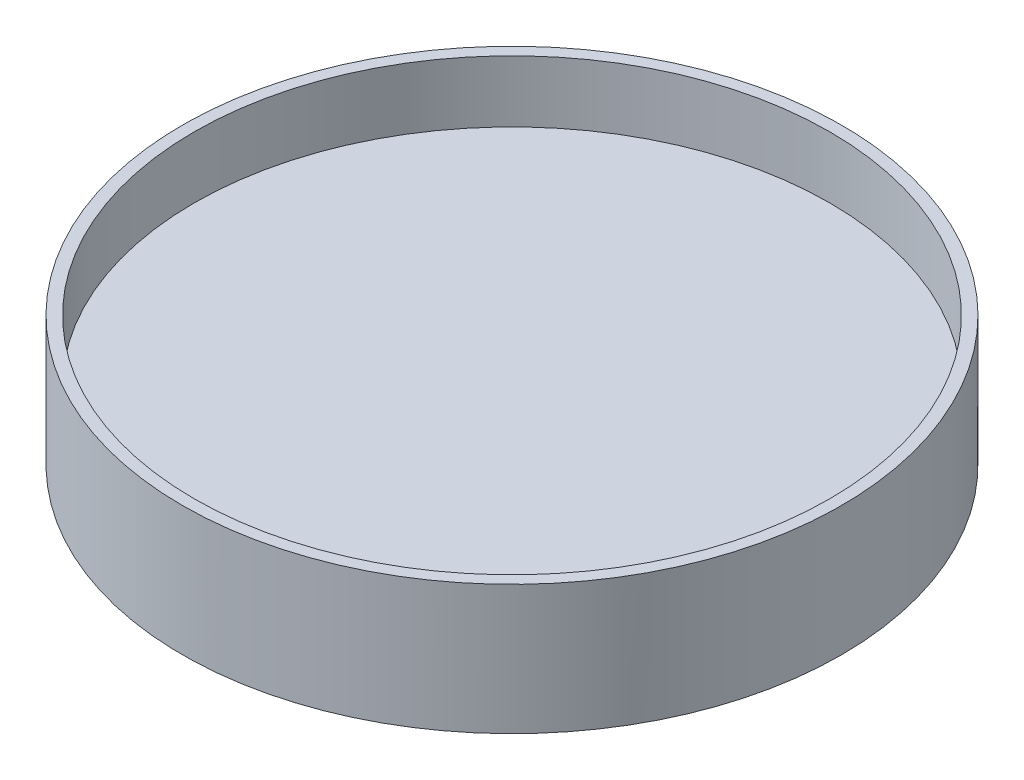
ISO-10303-21;
HEADER;
FILE_DESCRIPTION(('STEP AP214'),'2;1');
FILE_NAME('part.step','',(''),(''),'','','');
FILE_SCHEMA(('AUTOMOTIVE_DESIGN { 1 0 10303 214 1 1 1 1 }'));
ENDSEC;
DATA;
#1=APPLICATION_CONTEXT('core data for automotive mechanical design processes');
#2=APPLICATION_PROTOCOL_DEFINITION('international standard','automotive_design',2000,#1);
#3=PRODUCT_CONTEXT('',#1,'mechanical');
#4=PRODUCT('Part','Part','',(#3));
#5=PRODUCT_RELATED_PRODUCT_CATEGORY('part','',(#4));
#6=PRODUCT_DEFINITION_FORMATION('','',#4);
#7=PRODUCT_DEFINITION_CONTEXT('part definition',#1,'design');
#8=PRODUCT_DEFINITION('design','',#6,#7);
#9=PRODUCT_DEFINITION_SHAPE('','',#8);
#10=(LENGTH_UNIT() NAMED_UNIT(*) SI_UNIT(.MILLI.,.METRE.));
#11=(NAMED_UNIT(*) PLANE_ANGLE_UNIT() SI_UNIT($,.RADIAN.));
#12=(NAMED_UNIT(*) SI_UNIT($,.STERADIAN.) SOLID_ANGLE_UNIT());
#13=UNCERTAINTY_MEASURE_WITH_UNIT(LENGTH_MEASURE(1.E-05),#10,'distance_accuracy_value','');
#14=(GEOMETRIC_REPRESENTATION_CONTEXT(3) GLOBAL_UNCERTAINTY_ASSIGNED_CONTEXT((#13)) GLOBAL_UNIT_ASSIGNED_CONTEXT((#10,
#11,#12)) REPRESENTATION_CONTEXT('',''));
#15=CARTESIAN_POINT('',(0.,0.,0.));
#16=DIRECTION('',(0.,0.,1.));
#17=DIRECTION('',(1.,0.,0.));
#18=AXIS2_PLACEMENT_3D('',#15,#16,#17);
#19=CARTESIAN_POINT('',(0.,2.,0.));
#20=DIRECTION('',(0.,-1.,0.));
#21=DIRECTION('',(0.,0.,-1.));
#22=AXIS2_PLACEMENT_3D('',#19,#20,#21);
#23=CYLINDRICAL_SURFACE('',#22,53.5);
#24=CARTESIAN_POINT('',(0.,-9.,0.));
#25=DIRECTION('',(0.,-1.,0.));
#26=DIRECTION('',(0.,0.,-1.));
#27=AXIS2_PLACEMENT_3D('',#24,#25,#26);
#28=CIRCLE('',#27,53.5);
#29=CARTESIAN_POINT('',(15.6341934772697,-9.,-51.1646557138353));
#30=VERTEX_POINT('',#29);
#31=CARTESIAN_POINT('',(-15.6341934772697,-9.,-51.1646557138353));
#32=VERTEX_POINT('',#31);
#33=EDGE_CURVE('E105',#30,#32,#28,.T.);
#34=ORIENTED_EDGE('',*,*,#33,.F.);
#35=CARTESIAN_POINT('',(0.,-51.9545935501832,0.));
#36=DIRECTION('',(0.939692620785908,-0.342020143325669,0.));
#37=DIRECTION('',(-0.342020143325669,-0.939692620785909,0.));
#38=AXIS2_PLACEMENT_3D('',#35,#36,#37);
#39=ELLIPSE('',#38,156.423535408725,53.5);
#40=CARTESIAN_POINT('',(18.,-2.5,-50.3810480240338));
#41=VERTEX_POINT('',#40);
#42=EDGE_CURVE('E86',#30,#41,#39,.T.);
#43=ORIENTED_EDGE('',*,*,#42,.T.);
#44=CARTESIAN_POINT('',(0.,-2.5,0.));
#45=DIRECTION('',(0.,1.,0.));
#46=DIRECTION('',(0.,0.,1.));
#47=AXIS2_PLACEMENT_3D('',#44,#45,#46);
#48=CIRCLE('',#47,53.5);
#49=CARTESIAN_POINT('',(-18.,-2.5,-50.3810480240338));
#50=VERTEX_POINT('',#49);
#51=EDGE_CURVE('E95',#41,#50,#48,.T.);
#52=ORIENTED_EDGE('',*,*,#51,.T.);
#53=CARTESIAN_POINT('',(0.,-51.9545935501831,0.));
#54=DIRECTION('',(-0.939692620785908,-0.342020143325669,0.));
#55=DIRECTION('',(0.342020143325669,-0.939692620785908,0.));
#56=AXIS2_PLACEMENT_3D('',#53,#54,#55);
#57=ELLIPSE('',#56,156.423535408725,53.5);
#58=EDGE_CURVE('E101',#50,#32,#57,.T.);
#59=ORIENTED_EDGE('',*,*,#58,.T.);
#60=EDGE_LOOP('',(#34,#43,#52,#59));
#61=FACE_BOUND('',#60,.T.);
#62=CARTESIAN_POINT('',(0.,12.,0.));
#63=DIRECTION('',(0.,1.,0.));
#64=DIRECTION('',(0.,0.,1.));
#65=AXIS2_PLACEMENT_3D('',#62,#63,#64);
#66=CIRCLE('',#65,53.5);
#67=CARTESIAN_POINT('',(0.,12.,53.5));
#68=VERTEX_POINT('',#67);
#69=EDGE_CURVE('E46',#68,#68,#66,.T.);
#70=ORIENTED_EDGE('',*,*,#69,.F.);
#71=EDGE_LOOP('',(#70));
#72=FACE_BOUND('',#71,.T.);
#73=ADVANCED_FACE('F37',(#61,#72),#23,.T.);
#74=CARTESIAN_POINT('',(0.,12.,0.));
#75=DIRECTION('',(0.,1.,0.));
#76=DIRECTION('',(0.,0.,1.));
#77=AXIS2_PLACEMENT_3D('',#74,#75,#76);
#78=PLANE('',#77);
#79=ORIENTED_EDGE('',*,*,#69,.T.);
#80=EDGE_LOOP('',(#79));
#81=FACE_BOUND('',#80,.T.);
#82=CARTESIAN_POINT('',(0.,12.,0.));
#83=DIRECTION('',(0.,1.,0.));
#84=DIRECTION('',(0.,0.,1.));
#85=AXIS2_PLACEMENT_3D('',#82,#83,#84);
#86=CIRCLE('',#85,51.6);
#87=CARTESIAN_POINT('',(0.,12.,51.6));
#88=VERTEX_POINT('',#87);
#89=EDGE_CURVE('E113',#88,#88,#86,.T.);
#90=ORIENTED_EDGE('',*,*,#89,.F.);
#91=EDGE_LOOP('',(#90));
#92=FACE_BOUND('',#91,.T.);
#93=ADVANCED_FACE('F131',(#81,#92),#78,.T.);
#94=CARTESIAN_POINT('',(0.,12.,0.));
#95=DIRECTION('',(0.,-1.,0.));
#96=DIRECTION('',(0.,0.,-1.));
#97=AXIS2_PLACEMENT_3D('',#94,#95,#96);
#98=CYLINDRICAL_SURFACE('',#97,51.6);
#99=ORIENTED_EDGE('',*,*,#89,.T.);
#100=EDGE_LOOP('',(#99));
#101=FACE_BOUND('',#100,.T.);
#102=CARTESIAN_POINT('',(0.,2.,0.));
#103=DIRECTION('',(0.,1.,0.));
#104=DIRECTION('',(0.,0.,1.));
#105=AXIS2_PLACEMENT_3D('',#102,#103,#104);
#106=CIRCLE('',#105,51.6);
#107=CARTESIAN_POINT('',(0.,2.,51.6));
#108=VERTEX_POINT('',#107);
#109=EDGE_CURVE('E11',#108,#108,#106,.F.);
#110=ORIENTED_EDGE('',*,*,#109,.T.);
#111=EDGE_LOOP('',(#110));
#112=FACE_BOUND('',#111,.T.);
#113=ADVANCED_FACE('F135',(#101,#112),#98,.F.);
#114=CARTESIAN_POINT('',(0.,2.,0.));
#115=DIRECTION('',(0.,1.,0.));
#116=DIRECTION('',(0.,0.,1.));
#117=AXIS2_PLACEMENT_3D('',#114,#115,#116);
#118=PLANE('',#117);
#119=ORIENTED_EDGE('',*,*,#109,.F.);
#120=EDGE_LOOP('',(#119));
#121=FACE_BOUND('',#120,.T.);
#122=ADVANCED_FACE('F139',(#121),#118,.T.);
#123=CARTESIAN_POINT('',(0.,-9.,0.));
#124=DIRECTION('',(0.,-1.,0.));
#125=DIRECTION('',(0.,0.,-1.));
#126=AXIS2_PLACEMENT_3D('',#123,#124,#125);
#127=PLANE('',#126);
#128=DIRECTION('',(0.,0.,-1.));
#129=VECTOR('',#128,1.);
#130=CARTESIAN_POINT('',(15.6341934772697,-9.,0.));
#131=LINE('',#130,#129);
#132=CARTESIAN_POINT('',(15.6341934772697,-9.,15.6341934772697));
#133=VERTEX_POINT('',#132);
#134=EDGE_CURVE('E41',#30,#133,#131,.F.);
#135=ORIENTED_EDGE('',*,*,#134,.F.);
#136=ORIENTED_EDGE('',*,*,#33,.T.);
#137=DIRECTION('',(0.,0.,1.));
#138=VECTOR('',#137,1.);
#139=CARTESIAN_POINT('',(-15.6341934772697,-9.,0.));
#140=LINE('',#139,#138);
#141=CARTESIAN_POINT('',(-15.6341934772697,-9.,15.6341934772697));
#142=VERTEX_POINT('',#141);
#143=EDGE_CURVE('E92',#142,#32,#140,.F.);
#144=ORIENTED_EDGE('',*,*,#143,.F.);
#145=DIRECTION('',(1.,0.,0.));
#146=VECTOR('',#145,1.);
#147=CARTESIAN_POINT('',(0.,-9.,15.6341934772697));
#148=LINE('',#147,#146);
#149=EDGE_CURVE('E107',#133,#142,#148,.F.);
#150=ORIENTED_EDGE('',*,*,#149,.F.);
#151=EDGE_LOOP('',(#135,#136,#144,#150));
#152=FACE_BOUND('',#151,.T.);
#153=ADVANCED_FACE('F121',(#152),#127,.T.);
#154=CARTESIAN_POINT('',(18.,-2.5,-18.));
#155=DIRECTION('',(-0.939692620785908,0.342020143325669,0.));
#156=DIRECTION('',(-0.342020143325669,-0.939692620785908,0.));
#157=AXIS2_PLACEMENT_3D('',#154,#155,#156);
#158=PLANE('',#157);
#159=ORIENTED_EDGE('',*,*,#134,.T.);
#160=DIRECTION('',(-0.323615577118185,-0.889126490715988,-0.323615577118185));
#161=VECTOR('',#160,1.);
#162=CARTESIAN_POINT('',(14.2298264968727,-12.8584665672684,14.2298264968727));
#163=LINE('',#162,#161);
#164=CARTESIAN_POINT('',(18.,-2.5,18.));
#165=VERTEX_POINT('',#164);
#166=EDGE_CURVE('E88',#165,#133,#163,.T.);
#167=ORIENTED_EDGE('',*,*,#166,.F.);
#168=DIRECTION('',(0.,0.,1.));
#169=VECTOR('',#168,1.);
#170=CARTESIAN_POINT('',(18.,-2.5,-18.));
#171=LINE('',#170,#169);
#172=EDGE_CURVE('E82',#41,#165,#171,.T.);
#173=ORIENTED_EDGE('',*,*,#172,.F.);
#174=ORIENTED_EDGE('',*,*,#42,.F.);
#175=EDGE_LOOP('',(#159,#167,#173,#174));
#176=FACE_BOUND('',#175,.T.);
#177=ADVANCED_FACE('F84',(#176),#158,.T.);
#178=CARTESIAN_POINT('',(-18.,-2.5,-18.));
#179=DIRECTION('',(0.939692620785908,0.342020143325669,0.));
#180=DIRECTION('',(-0.342020143325669,0.939692620785908,0.));
#181=AXIS2_PLACEMENT_3D('',#178,#179,#180);
#182=PLANE('',#181);
#183=ORIENTED_EDGE('',*,*,#143,.T.);
#184=ORIENTED_EDGE('',*,*,#58,.F.);
#185=DIRECTION('',(0.,0.,-1.));
#186=VECTOR('',#185,1.);
#187=CARTESIAN_POINT('',(-18.,-2.5,-18.));
#188=LINE('',#187,#186);
#189=CARTESIAN_POINT('',(-18.,-2.5,18.));
#190=VERTEX_POINT('',#189);
#191=EDGE_CURVE('E97',#190,#50,#188,.T.);
#192=ORIENTED_EDGE('',*,*,#191,.F.);
#193=DIRECTION('',(0.323615577118185,-0.889126490715988,-0.323615577118185));
#194=VECTOR('',#193,1.);
#195=CARTESIAN_POINT('',(-18.,-2.5,18.));
#196=LINE('',#195,#194);
#197=EDGE_CURVE('E62',#190,#142,#196,.T.);
#198=ORIENTED_EDGE('',*,*,#197,.T.);
#199=EDGE_LOOP('',(#183,#184,#192,#198));
#200=FACE_BOUND('',#199,.T.);
#201=ADVANCED_FACE('F122',(#200),#182,.T.);
#202=CARTESIAN_POINT('',(-18.,-2.5,18.));
#203=DIRECTION('',(0.,0.342020143325669,-0.939692620785908));
#204=DIRECTION('',(0.,0.939692620785908,0.342020143325669));
#205=AXIS2_PLACEMENT_3D('',#202,#203,#204);
#206=PLANE('',#205);
#207=ORIENTED_EDGE('',*,*,#149,.T.);
#208=ORIENTED_EDGE('',*,*,#197,.F.);
#209=DIRECTION('',(-1.,0.,0.));
#210=VECTOR('',#209,1.);
#211=CARTESIAN_POINT('',(-18.,-2.5,18.));
#212=LINE('',#211,#210);
#213=EDGE_CURVE('E91',#165,#190,#212,.T.);
#214=ORIENTED_EDGE('',*,*,#213,.F.);
#215=ORIENTED_EDGE('',*,*,#166,.T.);
#216=EDGE_LOOP('',(#207,#208,#214,#215));
#217=FACE_BOUND('',#216,.T.);
#218=ADVANCED_FACE('F39',(#217),#206,.T.);
#219=CARTESIAN_POINT('',(0.,-2.5,0.));
#220=DIRECTION('',(0.,1.,0.));
#221=DIRECTION('',(0.,0.,1.));
#222=AXIS2_PLACEMENT_3D('',#219,#220,#221);
#223=PLANE('',#222);
#224=CARTESIAN_POINT('',(0.,-2.5,-37.));
#225=DIRECTION('',(0.,-1.,0.));
#226=DIRECTION('',(0.,0.,-1.));
#227=AXIS2_PLACEMENT_3D('',#224,#225,#226);
#228=CIRCLE('',#227,2.35);
#229=CARTESIAN_POINT('',(0.,-2.5,-39.35));
#230=VERTEX_POINT('',#229);
#231=EDGE_CURVE('E162',#230,#230,#228,.T.);
#232=ORIENTED_EDGE('',*,*,#231,.F.);
#233=EDGE_LOOP('',(#232));
#234=FACE_BOUND('',#233,.T.);
#235=ORIENTED_EDGE('',*,*,#172,.T.);
#236=ORIENTED_EDGE('',*,*,#213,.T.);
#237=ORIENTED_EDGE('',*,*,#191,.T.);
#238=ORIENTED_EDGE('',*,*,#51,.F.);
#239=EDGE_LOOP('',(#235,#236,#237,#238));
#240=FACE_BOUND('',#239,.T.);
#241=ADVANCED_FACE('F96',(#234,#240),#223,.F.);
#242=CARTESIAN_POINT('',(0.,1.5,-37.));
#243=DIRECTION('',(0.,-1.,0.));
#244=DIRECTION('',(0.,0.,-1.));
#245=AXIS2_PLACEMENT_3D('',#242,#243,#244);
#246=CYLINDRICAL_SURFACE('',#245,2.35);
#247=CARTESIAN_POINT('',(0.,1.5,-37.));
#248=DIRECTION('',(0.,-1.,0.));
#249=DIRECTION('',(0.,0.,-1.));
#250=AXIS2_PLACEMENT_3D('',#247,#248,#249);
#251=CIRCLE('',#250,2.35);
#252=CARTESIAN_POINT('',(0.,1.5,-39.35));
#253=VERTEX_POINT('',#252);
#254=EDGE_CURVE('E102',#253,#253,#251,.T.);
#255=ORIENTED_EDGE('',*,*,#254,.F.);
#256=EDGE_LOOP('',(#255));
#257=FACE_BOUND('',#256,.T.);
#258=ORIENTED_EDGE('',*,*,#231,.T.);
#259=EDGE_LOOP('',(#258));
#260=FACE_BOUND('',#259,.T.);
#261=ADVANCED_FACE('F150',(#257,#260),#246,.F.);
#262=CARTESIAN_POINT('',(0.,1.5,-37.));
#263=DIRECTION('',(0.,-1.,0.));
#264=DIRECTION('',(0.,0.,-1.));
#265=AXIS2_PLACEMENT_3D('',#262,#263,#264);
#266=PLANE('',#265);
#267=ORIENTED_EDGE('',*,*,#254,.T.);
#268=EDGE_LOOP('',(#267));
#269=FACE_BOUND('',#268,.T.);
#270=ADVANCED_FACE('F154',(#269),#266,.T.);
#271=CLOSED_SHELL('',(#73,#93,#113,#122,#153,#177,#201,#218,#241,#261,#270));
#272=MANIFOLD_SOLID_BREP('B2',#271);
#273=ADVANCED_BREP_SHAPE_REPRESENTATION('',(#18,#272),#14);
#274=SHAPE_DEFINITION_REPRESENTATION(#9,#273);
ENDSEC;
END-ISO-10303-21;
